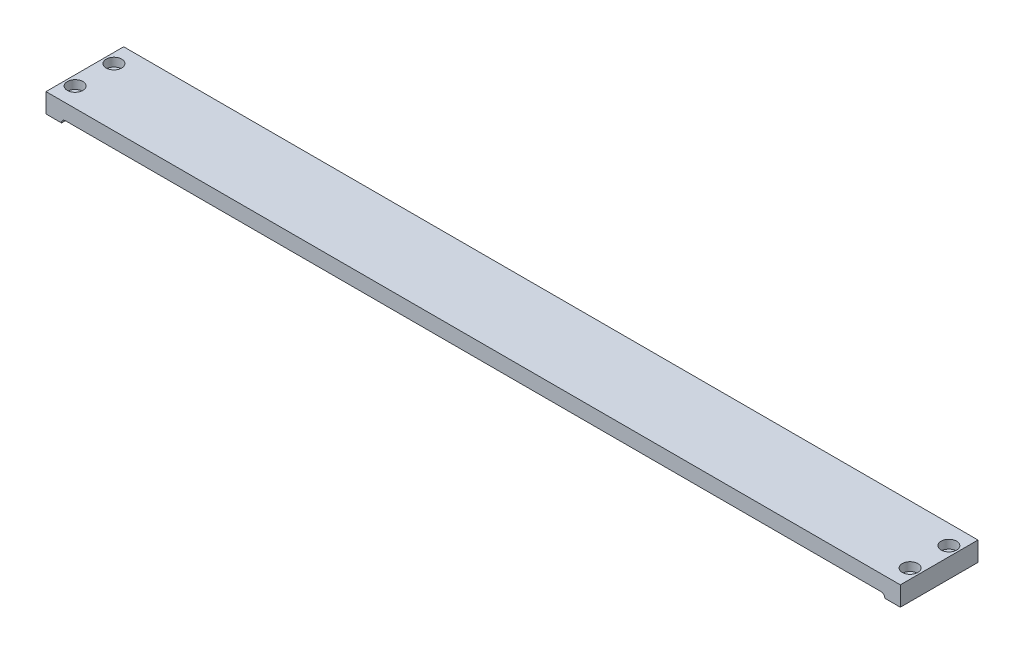
ISO-10303-21;
HEADER;
FILE_DESCRIPTION(('STEP AP214'),'2;1');
FILE_NAME('part.step','',(''),(''),'','','');
FILE_SCHEMA(('AUTOMOTIVE_DESIGN { 1 0 10303 214 1 1 1 1 }'));
ENDSEC;
DATA;
#1=APPLICATION_CONTEXT('core data for automotive mechanical design processes');
#2=APPLICATION_PROTOCOL_DEFINITION('international standard','automotive_design',2000,#1);
#3=PRODUCT_CONTEXT('',#1,'mechanical');
#4=PRODUCT('Part','Part','',(#3));
#5=PRODUCT_RELATED_PRODUCT_CATEGORY('part','',(#4));
#6=PRODUCT_DEFINITION_FORMATION('','',#4);
#7=PRODUCT_DEFINITION_CONTEXT('part definition',#1,'design');
#8=PRODUCT_DEFINITION('design','',#6,#7);
#9=PRODUCT_DEFINITION_SHAPE('','',#8);
#10=(LENGTH_UNIT() NAMED_UNIT(*) SI_UNIT(.MILLI.,.METRE.));
#11=(NAMED_UNIT(*) PLANE_ANGLE_UNIT() SI_UNIT($,.RADIAN.));
#12=(NAMED_UNIT(*) SI_UNIT($,.STERADIAN.) SOLID_ANGLE_UNIT());
#13=UNCERTAINTY_MEASURE_WITH_UNIT(LENGTH_MEASURE(1.E-05),#10,'distance_accuracy_value','');
#14=(GEOMETRIC_REPRESENTATION_CONTEXT(3) GLOBAL_UNCERTAINTY_ASSIGNED_CONTEXT((#13)) GLOBAL_UNIT_ASSIGNED_CONTEXT((#10,
#11,#12)) REPRESENTATION_CONTEXT('',''));
#15=CARTESIAN_POINT('',(0.,0.,0.));
#16=DIRECTION('',(0.,0.,1.));
#17=DIRECTION('',(1.,0.,0.));
#18=AXIS2_PLACEMENT_3D('',#15,#16,#17);
#19=CARTESIAN_POINT('',(220.,10.,20.));
#20=DIRECTION('',(-1.,0.,0.));
#21=DIRECTION('',(0.,0.,1.));
#22=AXIS2_PLACEMENT_3D('',#19,#20,#21);
#23=PLANE('',#22);
#24=DIRECTION('',(0.,0.,-1.));
#25=VECTOR('',#24,1.);
#26=CARTESIAN_POINT('',(220.,0.,20.));
#27=LINE('',#26,#25);
#28=CARTESIAN_POINT('',(220.,0.,20.));
#29=VERTEX_POINT('',#28);
#30=CARTESIAN_POINT('',(220.,0.,-20.));
#31=VERTEX_POINT('',#30);
#32=EDGE_CURVE('E184',#29,#31,#27,.T.);
#33=ORIENTED_EDGE('',*,*,#32,.T.);
#34=DIRECTION('',(0.,-1.,0.));
#35=VECTOR('',#34,1.);
#36=CARTESIAN_POINT('',(220.,10.,-20.));
#37=LINE('',#36,#35);
#38=CARTESIAN_POINT('',(220.,10.,-20.));
#39=VERTEX_POINT('',#38);
#40=EDGE_CURVE('E215',#39,#31,#37,.T.);
#41=ORIENTED_EDGE('',*,*,#40,.F.);
#42=DIRECTION('',(0.,0.,-1.));
#43=VECTOR('',#42,1.);
#44=CARTESIAN_POINT('',(220.,10.,20.));
#45=LINE('',#44,#43);
#46=CARTESIAN_POINT('',(220.,10.,20.));
#47=VERTEX_POINT('',#46);
#48=EDGE_CURVE('E187',#47,#39,#45,.T.);
#49=ORIENTED_EDGE('',*,*,#48,.F.);
#50=DIRECTION('',(0.,-1.,0.));
#51=VECTOR('',#50,1.);
#52=CARTESIAN_POINT('',(220.,10.,20.));
#53=LINE('',#52,#51);
#54=EDGE_CURVE('E197',#47,#29,#53,.T.);
#55=ORIENTED_EDGE('',*,*,#54,.T.);
#56=EDGE_LOOP('',(#33,#41,#49,#55));
#57=FACE_BOUND('',#56,.T.);
#58=ADVANCED_FACE('F34',(#57),#23,.F.);
#59=CARTESIAN_POINT('',(-220.,10.,-20.));
#60=DIRECTION('',(0.,0.,1.));
#61=DIRECTION('',(1.,0.,0.));
#62=AXIS2_PLACEMENT_3D('',#59,#60,#61);
#63=PLANE('',#62);
#64=CARTESIAN_POINT('',(-125.,5.,-20.));
#65=DIRECTION('',(0.,0.,-1.));
#66=DIRECTION('',(-1.,0.,0.));
#67=AXIS2_PLACEMENT_3D('',#64,#65,#66);
#68=CIRCLE('',#67,1.65);
#69=CARTESIAN_POINT('',(-126.65,5.,-20.));
#70=VERTEX_POINT('',#69);
#71=EDGE_CURVE('E119',#70,#70,#68,.T.);
#72=ORIENTED_EDGE('',*,*,#71,.F.);
#73=EDGE_LOOP('',(#72));
#74=FACE_BOUND('',#73,.T.);
#75=CARTESIAN_POINT('',(0.,5.,-20.));
#76=DIRECTION('',(0.,0.,-1.));
#77=DIRECTION('',(-1.,0.,0.));
#78=AXIS2_PLACEMENT_3D('',#75,#76,#77);
#79=CIRCLE('',#78,1.65);
#80=CARTESIAN_POINT('',(-1.65,5.,-20.));
#81=VERTEX_POINT('',#80);
#82=EDGE_CURVE('E118',#81,#81,#79,.T.);
#83=ORIENTED_EDGE('',*,*,#82,.F.);
#84=EDGE_LOOP('',(#83));
#85=FACE_BOUND('',#84,.T.);
#86=CARTESIAN_POINT('',(125.,5.,-20.));
#87=DIRECTION('',(0.,0.,-1.));
#88=DIRECTION('',(-1.,0.,0.));
#89=AXIS2_PLACEMENT_3D('',#86,#87,#88);
#90=CIRCLE('',#89,1.64999999999998);
#91=CARTESIAN_POINT('',(123.35,5.,-20.));
#92=VERTEX_POINT('',#91);
#93=EDGE_CURVE('E129',#92,#92,#90,.T.);
#94=ORIENTED_EDGE('',*,*,#93,.F.);
#95=EDGE_LOOP('',(#94));
#96=FACE_BOUND('',#95,.T.);
#97=DIRECTION('',(-1.,0.,0.));
#98=VECTOR('',#97,1.);
#99=CARTESIAN_POINT('',(-220.,0.,-20.));
#100=LINE('',#99,#98);
#101=CARTESIAN_POINT('',(-220.,0.,-20.));
#102=VERTEX_POINT('',#101);
#103=EDGE_CURVE('E200',#31,#102,#100,.T.);
#104=ORIENTED_EDGE('',*,*,#103,.T.);
#105=DIRECTION('',(0.,-1.,0.));
#106=VECTOR('',#105,1.);
#107=CARTESIAN_POINT('',(-220.,10.,-20.));
#108=LINE('',#107,#106);
#109=CARTESIAN_POINT('',(-220.,10.,-20.));
#110=VERTEX_POINT('',#109);
#111=EDGE_CURVE('E212',#110,#102,#108,.T.);
#112=ORIENTED_EDGE('',*,*,#111,.F.);
#113=DIRECTION('',(-1.,0.,0.));
#114=VECTOR('',#113,1.);
#115=CARTESIAN_POINT('',(-220.,10.,-20.));
#116=LINE('',#115,#114);
#117=EDGE_CURVE('E190',#39,#110,#116,.T.);
#118=ORIENTED_EDGE('',*,*,#117,.F.);
#119=ORIENTED_EDGE('',*,*,#40,.T.);
#120=EDGE_LOOP('',(#104,#112,#118,#119));
#121=FACE_BOUND('',#120,.T.);
#122=ADVANCED_FACE('F267',(#74,#85,#96,#121),#63,.F.);
#123=CARTESIAN_POINT('',(-220.,10.,20.));
#124=DIRECTION('',(1.,0.,0.));
#125=DIRECTION('',(0.,0.,-1.));
#126=AXIS2_PLACEMENT_3D('',#123,#124,#125);
#127=PLANE('',#126);
#128=DIRECTION('',(0.,0.,1.));
#129=VECTOR('',#128,1.);
#130=CARTESIAN_POINT('',(-220.,0.,20.));
#131=LINE('',#130,#129);
#132=CARTESIAN_POINT('',(-220.,0.,20.));
#133=VERTEX_POINT('',#132);
#134=EDGE_CURVE('E202',#102,#133,#131,.T.);
#135=ORIENTED_EDGE('',*,*,#134,.T.);
#136=DIRECTION('',(0.,-1.,0.));
#137=VECTOR('',#136,1.);
#138=CARTESIAN_POINT('',(-220.,10.,20.));
#139=LINE('',#138,#137);
#140=CARTESIAN_POINT('',(-220.,10.,20.));
#141=VERTEX_POINT('',#140);
#142=EDGE_CURVE('E209',#141,#133,#139,.T.);
#143=ORIENTED_EDGE('',*,*,#142,.F.);
#144=DIRECTION('',(0.,0.,1.));
#145=VECTOR('',#144,1.);
#146=CARTESIAN_POINT('',(-220.,10.,20.));
#147=LINE('',#146,#145);
#148=EDGE_CURVE('E193',#110,#141,#147,.T.);
#149=ORIENTED_EDGE('',*,*,#148,.F.);
#150=ORIENTED_EDGE('',*,*,#111,.T.);
#151=EDGE_LOOP('',(#135,#143,#149,#150));
#152=FACE_BOUND('',#151,.T.);
#153=ADVANCED_FACE('F261',(#152),#127,.F.);
#154=CARTESIAN_POINT('',(-220.,10.,20.));
#155=DIRECTION('',(0.,0.,-1.));
#156=DIRECTION('',(-1.,0.,0.));
#157=AXIS2_PLACEMENT_3D('',#154,#155,#156);
#158=PLANE('',#157);
#159=DIRECTION('',(1.,0.,0.));
#160=VECTOR('',#159,1.);
#161=CARTESIAN_POINT('',(-220.,0.,20.));
#162=LINE('',#161,#160);
#163=CARTESIAN_POINT('',(-212.,0.,20.));
#164=VERTEX_POINT('',#163);
#165=EDGE_CURVE('E191',#133,#164,#162,.T.);
#166=ORIENTED_EDGE('',*,*,#165,.T.);
#167=CARTESIAN_POINT('',(-210.,0.,20.));
#168=DIRECTION('',(0.,0.,-1.));
#169=DIRECTION('',(-1.,0.,0.));
#170=AXIS2_PLACEMENT_3D('',#167,#168,#169);
#171=CIRCLE('',#170,2.);
#172=CARTESIAN_POINT('',(-210.,2.,20.));
#173=VERTEX_POINT('',#172);
#174=EDGE_CURVE('E43',#164,#173,#171,.T.);
#175=ORIENTED_EDGE('',*,*,#174,.T.);
#176=DIRECTION('',(-1.,0.,0.));
#177=VECTOR('',#176,1.);
#178=CARTESIAN_POINT('',(-212.,2.,20.));
#179=LINE('',#178,#177);
#180=CARTESIAN_POINT('',(210.,2.,20.));
#181=VERTEX_POINT('',#180);
#182=EDGE_CURVE('E177',#181,#173,#179,.T.);
#183=ORIENTED_EDGE('',*,*,#182,.F.);
#184=CARTESIAN_POINT('',(210.,0.,20.));
#185=DIRECTION('',(0.,0.,-1.));
#186=DIRECTION('',(-1.,0.,0.));
#187=AXIS2_PLACEMENT_3D('',#184,#185,#186);
#188=CIRCLE('',#187,2.);
#189=CARTESIAN_POINT('',(212.,0.,20.));
#190=VERTEX_POINT('',#189);
#191=EDGE_CURVE('E11',#181,#190,#188,.T.);
#192=ORIENTED_EDGE('',*,*,#191,.T.);
#193=EDGE_CURVE('E204',#190,#29,#162,.T.);
#194=ORIENTED_EDGE('',*,*,#193,.T.);
#195=ORIENTED_EDGE('',*,*,#54,.F.);
#196=DIRECTION('',(1.,0.,0.));
#197=VECTOR('',#196,1.);
#198=CARTESIAN_POINT('',(-220.,10.,20.));
#199=LINE('',#198,#197);
#200=EDGE_CURVE('E195',#141,#47,#199,.T.);
#201=ORIENTED_EDGE('',*,*,#200,.F.);
#202=ORIENTED_EDGE('',*,*,#142,.T.);
#203=EDGE_LOOP('',(#166,#175,#183,#192,#194,#195,#201,#202));
#204=FACE_BOUND('',#203,.T.);
#205=ADVANCED_FACE('F254',(#204),#158,.F.);
#206=CARTESIAN_POINT('',(0.,10.,0.));
#207=DIRECTION('',(0.,-1.,0.));
#208=DIRECTION('',(0.,0.,-1.));
#209=AXIS2_PLACEMENT_3D('',#206,#207,#208);
#210=PLANE('',#209);
#211=CARTESIAN_POINT('',(215.,10.,-10.));
#212=DIRECTION('',(0.,1.,0.));
#213=DIRECTION('',(0.,0.,1.));
#214=AXIS2_PLACEMENT_3D('',#211,#212,#213);
#215=CIRCLE('',#214,4.);
#216=CARTESIAN_POINT('',(215.,10.,-6.));
#217=VERTEX_POINT('',#216);
#218=EDGE_CURVE('E135',#217,#217,#215,.T.);
#219=ORIENTED_EDGE('',*,*,#218,.F.);
#220=EDGE_LOOP('',(#219));
#221=FACE_BOUND('',#220,.T.);
#222=CARTESIAN_POINT('',(215.,10.,10.));
#223=DIRECTION('',(0.,1.,0.));
#224=DIRECTION('',(0.,0.,1.));
#225=AXIS2_PLACEMENT_3D('',#222,#223,#224);
#226=CIRCLE('',#225,4.);
#227=CARTESIAN_POINT('',(215.,10.,14.));
#228=VERTEX_POINT('',#227);
#229=EDGE_CURVE('E144',#228,#228,#226,.T.);
#230=ORIENTED_EDGE('',*,*,#229,.F.);
#231=EDGE_LOOP('',(#230));
#232=FACE_BOUND('',#231,.T.);
#233=CARTESIAN_POINT('',(-215.,10.,-10.));
#234=DIRECTION('',(0.,1.,0.));
#235=DIRECTION('',(0.,0.,1.));
#236=AXIS2_PLACEMENT_3D('',#233,#234,#235);
#237=CIRCLE('',#236,4.);
#238=CARTESIAN_POINT('',(-215.,10.,-6.));
#239=VERTEX_POINT('',#238);
#240=EDGE_CURVE('E154',#239,#239,#237,.T.);
#241=ORIENTED_EDGE('',*,*,#240,.F.);
#242=EDGE_LOOP('',(#241));
#243=FACE_BOUND('',#242,.T.);
#244=CARTESIAN_POINT('',(-215.,10.,10.));
#245=DIRECTION('',(0.,1.,0.));
#246=DIRECTION('',(0.,0.,1.));
#247=AXIS2_PLACEMENT_3D('',#244,#245,#246);
#248=CIRCLE('',#247,4.);
#249=CARTESIAN_POINT('',(-215.,10.,14.));
#250=VERTEX_POINT('',#249);
#251=EDGE_CURVE('E164',#250,#250,#248,.T.);
#252=ORIENTED_EDGE('',*,*,#251,.F.);
#253=EDGE_LOOP('',(#252));
#254=FACE_BOUND('',#253,.T.);
#255=ORIENTED_EDGE('',*,*,#48,.T.);
#256=ORIENTED_EDGE('',*,*,#117,.T.);
#257=ORIENTED_EDGE('',*,*,#148,.T.);
#258=ORIENTED_EDGE('',*,*,#200,.T.);
#259=EDGE_LOOP('',(#255,#256,#257,#258));
#260=FACE_BOUND('',#259,.T.);
#261=ADVANCED_FACE('F239',(#221,#232,#243,#254,#260),#210,.F.);
#262=CARTESIAN_POINT('',(0.,0.,0.));
#263=DIRECTION('',(0.,-1.,0.));
#264=DIRECTION('',(0.,0.,-1.));
#265=AXIS2_PLACEMENT_3D('',#262,#263,#264);
#266=PLANE('',#265);
#267=CARTESIAN_POINT('',(215.,0.,-10.));
#268=DIRECTION('',(0.,-1.,0.));
#269=DIRECTION('',(0.,0.,-1.));
#270=AXIS2_PLACEMENT_3D('',#267,#268,#269);
#271=CIRCLE('',#270,2.25);
#272=CARTESIAN_POINT('',(215.,0.,-12.25));
#273=VERTEX_POINT('',#272);
#274=EDGE_CURVE('E38',#273,#273,#271,.T.);
#275=ORIENTED_EDGE('',*,*,#274,.F.);
#276=EDGE_LOOP('',(#275));
#277=FACE_BOUND('',#276,.T.);
#278=CARTESIAN_POINT('',(215.,0.,10.));
#279=DIRECTION('',(0.,-1.,0.));
#280=DIRECTION('',(0.,0.,-1.));
#281=AXIS2_PLACEMENT_3D('',#278,#279,#280);
#282=CIRCLE('',#281,2.25);
#283=CARTESIAN_POINT('',(215.,0.,7.75));
#284=VERTEX_POINT('',#283);
#285=EDGE_CURVE('E153',#284,#284,#282,.T.);
#286=ORIENTED_EDGE('',*,*,#285,.F.);
#287=EDGE_LOOP('',(#286));
#288=FACE_BOUND('',#287,.T.);
#289=CARTESIAN_POINT('',(-215.,0.,-10.));
#290=DIRECTION('',(0.,-1.,0.));
#291=DIRECTION('',(0.,0.,-1.));
#292=AXIS2_PLACEMENT_3D('',#289,#290,#291);
#293=CIRCLE('',#292,2.25);
#294=CARTESIAN_POINT('',(-215.,0.,-12.25));
#295=VERTEX_POINT('',#294);
#296=EDGE_CURVE('E163',#295,#295,#293,.T.);
#297=ORIENTED_EDGE('',*,*,#296,.F.);
#298=EDGE_LOOP('',(#297));
#299=FACE_BOUND('',#298,.T.);
#300=CARTESIAN_POINT('',(-215.,0.,10.));
#301=DIRECTION('',(0.,-1.,0.));
#302=DIRECTION('',(0.,0.,-1.));
#303=AXIS2_PLACEMENT_3D('',#300,#301,#302);
#304=CIRCLE('',#303,2.25);
#305=CARTESIAN_POINT('',(-215.,0.,7.75));
#306=VERTEX_POINT('',#305);
#307=EDGE_CURVE('E173',#306,#306,#304,.T.);
#308=ORIENTED_EDGE('',*,*,#307,.F.);
#309=EDGE_LOOP('',(#308));
#310=FACE_BOUND('',#309,.T.);
#311=DIRECTION('',(0.,0.,1.));
#312=VECTOR('',#311,1.);
#313=CARTESIAN_POINT('',(-212.,0.,18.));
#314=LINE('',#313,#312);
#315=CARTESIAN_POINT('',(-212.,0.,18.));
#316=VERTEX_POINT('',#315);
#317=EDGE_CURVE('E179',#316,#164,#314,.T.);
#318=ORIENTED_EDGE('',*,*,#317,.T.);
#319=ORIENTED_EDGE('',*,*,#165,.F.);
#320=ORIENTED_EDGE('',*,*,#134,.F.);
#321=ORIENTED_EDGE('',*,*,#103,.F.);
#322=ORIENTED_EDGE('',*,*,#32,.F.);
#323=ORIENTED_EDGE('',*,*,#193,.F.);
#324=DIRECTION('',(0.,0.,1.));
#325=VECTOR('',#324,1.);
#326=CARTESIAN_POINT('',(212.,0.,18.));
#327=LINE('',#326,#325);
#328=CARTESIAN_POINT('',(212.,0.,18.));
#329=VERTEX_POINT('',#328);
#330=EDGE_CURVE('E181',#329,#190,#327,.T.);
#331=ORIENTED_EDGE('',*,*,#330,.F.);
#332=DIRECTION('',(1.,0.,0.));
#333=VECTOR('',#332,1.);
#334=CARTESIAN_POINT('',(-212.,0.,18.));
#335=LINE('',#334,#333);
#336=EDGE_CURVE('E174',#316,#329,#335,.T.);
#337=ORIENTED_EDGE('',*,*,#336,.F.);
#338=EDGE_LOOP('',(#318,#319,#320,#321,#322,#323,#331,#337));
#339=FACE_BOUND('',#338,.T.);
#340=ADVANCED_FACE('F235',(#277,#288,#299,#310,#339),#266,.T.);
#341=CARTESIAN_POINT('',(-212.,2.,18.));
#342=DIRECTION('',(0.,1.,0.));
#343=DIRECTION('',(0.,0.,1.));
#344=AXIS2_PLACEMENT_3D('',#341,#342,#343);
#345=PLANE('',#344);
#346=ORIENTED_EDGE('',*,*,#182,.T.);
#347=DIRECTION('',(0.,0.,1.));
#348=VECTOR('',#347,1.);
#349=CARTESIAN_POINT('',(-210.,2.,18.));
#350=LINE('',#349,#348);
#351=CARTESIAN_POINT('',(-210.,2.,18.));
#352=VERTEX_POINT('',#351);
#353=EDGE_CURVE('E51',#173,#352,#350,.F.);
#354=ORIENTED_EDGE('',*,*,#353,.T.);
#355=DIRECTION('',(-1.,0.,0.));
#356=VECTOR('',#355,1.);
#357=CARTESIAN_POINT('',(-212.,2.,18.));
#358=LINE('',#357,#356);
#359=CARTESIAN_POINT('',(210.,2.,18.));
#360=VERTEX_POINT('',#359);
#361=EDGE_CURVE('E176',#360,#352,#358,.T.);
#362=ORIENTED_EDGE('',*,*,#361,.F.);
#363=DIRECTION('',(0.,0.,1.));
#364=VECTOR('',#363,1.);
#365=CARTESIAN_POINT('',(210.,2.,20.));
#366=LINE('',#365,#364);
#367=EDGE_CURVE('E218',#360,#181,#366,.T.);
#368=ORIENTED_EDGE('',*,*,#367,.T.);
#369=EDGE_LOOP('',(#346,#354,#362,#368));
#370=FACE_BOUND('',#369,.T.);
#371=ADVANCED_FACE('F238',(#370),#345,.F.);
#372=CARTESIAN_POINT('',(0.,0.,18.));
#373=DIRECTION('',(0.,0.,-1.));
#374=DIRECTION('',(-1.,0.,0.));
#375=AXIS2_PLACEMENT_3D('',#372,#373,#374);
#376=PLANE('',#375);
#377=ORIENTED_EDGE('',*,*,#361,.T.);
#378=CARTESIAN_POINT('',(-210.,0.,18.));
#379=DIRECTION('',(0.,0.,-1.));
#380=DIRECTION('',(-1.,0.,0.));
#381=AXIS2_PLACEMENT_3D('',#378,#379,#380);
#382=CIRCLE('',#381,2.);
#383=EDGE_CURVE('E223',#352,#316,#382,.F.);
#384=ORIENTED_EDGE('',*,*,#383,.T.);
#385=ORIENTED_EDGE('',*,*,#336,.T.);
#386=CARTESIAN_POINT('',(210.,0.,18.));
#387=DIRECTION('',(0.,0.,-1.));
#388=DIRECTION('',(-1.,0.,0.));
#389=AXIS2_PLACEMENT_3D('',#386,#387,#388);
#390=CIRCLE('',#389,2.);
#391=EDGE_CURVE('E58',#329,#360,#390,.F.);
#392=ORIENTED_EDGE('',*,*,#391,.T.);
#393=EDGE_LOOP('',(#377,#384,#385,#392));
#394=FACE_BOUND('',#393,.T.);
#395=ADVANCED_FACE('F272',(#394),#376,.F.);
#396=CARTESIAN_POINT('',(-210.,0.,18.));
#397=DIRECTION('',(0.,0.,-1.));
#398=DIRECTION('',(-1.,0.,0.));
#399=AXIS2_PLACEMENT_3D('',#396,#397,#398);
#400=CYLINDRICAL_SURFACE('',#399,2.);
#401=ORIENTED_EDGE('',*,*,#383,.F.);
#402=ORIENTED_EDGE('',*,*,#353,.F.);
#403=ORIENTED_EDGE('',*,*,#174,.F.);
#404=ORIENTED_EDGE('',*,*,#317,.F.);
#405=EDGE_LOOP('',(#401,#402,#403,#404));
#406=FACE_BOUND('',#405,.T.);
#407=ADVANCED_FACE('F273',(#406),#400,.F.);
#408=CARTESIAN_POINT('',(210.,0.,18.));
#409=DIRECTION('',(0.,0.,-1.));
#410=DIRECTION('',(-1.,0.,0.));
#411=AXIS2_PLACEMENT_3D('',#408,#409,#410);
#412=CYLINDRICAL_SURFACE('',#411,2.);
#413=ORIENTED_EDGE('',*,*,#391,.F.);
#414=ORIENTED_EDGE('',*,*,#330,.T.);
#415=ORIENTED_EDGE('',*,*,#191,.F.);
#416=ORIENTED_EDGE('',*,*,#367,.F.);
#417=EDGE_LOOP('',(#413,#414,#415,#416));
#418=FACE_BOUND('',#417,.T.);
#419=ADVANCED_FACE('F36',(#418),#412,.F.);
#420=CARTESIAN_POINT('',(-215.,10.,10.));
#421=DIRECTION('',(0.,1.,0.));
#422=DIRECTION('',(0.,0.,1.));
#423=AXIS2_PLACEMENT_3D('',#420,#421,#422);
#424=CYLINDRICAL_SURFACE('',#423,2.25);
#425=ORIENTED_EDGE('',*,*,#307,.T.);
#426=EDGE_LOOP('',(#425));
#427=FACE_BOUND('',#426,.T.);
#428=CARTESIAN_POINT('',(-215.,5.6,10.));
#429=DIRECTION('',(0.,1.,0.));
#430=DIRECTION('',(0.,0.,1.));
#431=AXIS2_PLACEMENT_3D('',#428,#429,#430);
#432=CIRCLE('',#431,2.25);
#433=CARTESIAN_POINT('',(-215.,5.6,12.25));
#434=VERTEX_POINT('',#433);
#435=EDGE_CURVE('E170',#434,#434,#432,.T.);
#436=ORIENTED_EDGE('',*,*,#435,.T.);
#437=EDGE_LOOP('',(#436));
#438=FACE_BOUND('',#437,.T.);
#439=ADVANCED_FACE('F279',(#427,#438),#424,.F.);
#440=CARTESIAN_POINT('',(-212.75,5.6,10.));
#441=DIRECTION('',(0.,-1.,0.));
#442=DIRECTION('',(0.,0.,-1.));
#443=AXIS2_PLACEMENT_3D('',#440,#441,#442);
#444=PLANE('',#443);
#445=ORIENTED_EDGE('',*,*,#435,.F.);
#446=EDGE_LOOP('',(#445));
#447=FACE_BOUND('',#446,.T.);
#448=CARTESIAN_POINT('',(-215.,5.6,10.));
#449=DIRECTION('',(0.,1.,0.));
#450=DIRECTION('',(0.,0.,1.));
#451=AXIS2_PLACEMENT_3D('',#448,#449,#450);
#452=CIRCLE('',#451,4.);
#453=CARTESIAN_POINT('',(-215.,5.6,14.));
#454=VERTEX_POINT('',#453);
#455=EDGE_CURVE('E167',#454,#454,#452,.T.);
#456=ORIENTED_EDGE('',*,*,#455,.T.);
#457=EDGE_LOOP('',(#456));
#458=FACE_BOUND('',#457,.T.);
#459=ADVANCED_FACE('F300',(#447,#458),#444,.F.);
#460=CARTESIAN_POINT('',(-215.,10.,10.));
#461=DIRECTION('',(0.,1.,0.));
#462=DIRECTION('',(0.,0.,1.));
#463=AXIS2_PLACEMENT_3D('',#460,#461,#462);
#464=CYLINDRICAL_SURFACE('',#463,4.);
#465=ORIENTED_EDGE('',*,*,#455,.F.);
#466=EDGE_LOOP('',(#465));
#467=FACE_BOUND('',#466,.T.);
#468=ORIENTED_EDGE('',*,*,#251,.T.);
#469=EDGE_LOOP('',(#468));
#470=FACE_BOUND('',#469,.T.);
#471=ADVANCED_FACE('F304',(#467,#470),#464,.F.);
#472=CARTESIAN_POINT('',(-215.,10.,-10.));
#473=DIRECTION('',(0.,1.,0.));
#474=DIRECTION('',(0.,0.,1.));
#475=AXIS2_PLACEMENT_3D('',#472,#473,#474);
#476=CYLINDRICAL_SURFACE('',#475,2.25);
#477=ORIENTED_EDGE('',*,*,#296,.T.);
#478=EDGE_LOOP('',(#477));
#479=FACE_BOUND('',#478,.T.);
#480=CARTESIAN_POINT('',(-215.,5.6,-10.));
#481=DIRECTION('',(0.,1.,0.));
#482=DIRECTION('',(0.,0.,1.));
#483=AXIS2_PLACEMENT_3D('',#480,#481,#482);
#484=CIRCLE('',#483,2.25);
#485=CARTESIAN_POINT('',(-215.,5.6,-7.75));
#486=VERTEX_POINT('',#485);
#487=EDGE_CURVE('E160',#486,#486,#484,.T.);
#488=ORIENTED_EDGE('',*,*,#487,.T.);
#489=EDGE_LOOP('',(#488));
#490=FACE_BOUND('',#489,.T.);
#491=ADVANCED_FACE('F308',(#479,#490),#476,.F.);
#492=CARTESIAN_POINT('',(-212.75,5.6,-10.));
#493=DIRECTION('',(0.,-1.,0.));
#494=DIRECTION('',(0.,0.,-1.));
#495=AXIS2_PLACEMENT_3D('',#492,#493,#494);
#496=PLANE('',#495);
#497=ORIENTED_EDGE('',*,*,#487,.F.);
#498=EDGE_LOOP('',(#497));
#499=FACE_BOUND('',#498,.T.);
#500=CARTESIAN_POINT('',(-215.,5.6,-10.));
#501=DIRECTION('',(0.,1.,0.));
#502=DIRECTION('',(0.,0.,1.));
#503=AXIS2_PLACEMENT_3D('',#500,#501,#502);
#504=CIRCLE('',#503,4.);
#505=CARTESIAN_POINT('',(-215.,5.6,-6.));
#506=VERTEX_POINT('',#505);
#507=EDGE_CURVE('E157',#506,#506,#504,.T.);
#508=ORIENTED_EDGE('',*,*,#507,.T.);
#509=EDGE_LOOP('',(#508));
#510=FACE_BOUND('',#509,.T.);
#511=ADVANCED_FACE('F312',(#499,#510),#496,.F.);
#512=CARTESIAN_POINT('',(-215.,10.,-10.));
#513=DIRECTION('',(0.,1.,0.));
#514=DIRECTION('',(0.,0.,1.));
#515=AXIS2_PLACEMENT_3D('',#512,#513,#514);
#516=CYLINDRICAL_SURFACE('',#515,4.);
#517=ORIENTED_EDGE('',*,*,#507,.F.);
#518=EDGE_LOOP('',(#517));
#519=FACE_BOUND('',#518,.T.);
#520=ORIENTED_EDGE('',*,*,#240,.T.);
#521=EDGE_LOOP('',(#520));
#522=FACE_BOUND('',#521,.T.);
#523=ADVANCED_FACE('F316',(#519,#522),#516,.F.);
#524=CARTESIAN_POINT('',(215.,10.,10.));
#525=DIRECTION('',(0.,1.,0.));
#526=DIRECTION('',(0.,0.,1.));
#527=AXIS2_PLACEMENT_3D('',#524,#525,#526);
#528=CYLINDRICAL_SURFACE('',#527,2.25);
#529=ORIENTED_EDGE('',*,*,#285,.T.);
#530=EDGE_LOOP('',(#529));
#531=FACE_BOUND('',#530,.T.);
#532=CARTESIAN_POINT('',(215.,5.6,10.));
#533=DIRECTION('',(0.,1.,0.));
#534=DIRECTION('',(0.,0.,1.));
#535=AXIS2_PLACEMENT_3D('',#532,#533,#534);
#536=CIRCLE('',#535,2.25);
#537=CARTESIAN_POINT('',(215.,5.6,12.25));
#538=VERTEX_POINT('',#537);
#539=EDGE_CURVE('E150',#538,#538,#536,.T.);
#540=ORIENTED_EDGE('',*,*,#539,.T.);
#541=EDGE_LOOP('',(#540));
#542=FACE_BOUND('',#541,.T.);
#543=ADVANCED_FACE('F232',(#531,#542),#528,.F.);
#544=CARTESIAN_POINT('',(217.25,5.6,10.));
#545=DIRECTION('',(0.,-1.,0.));
#546=DIRECTION('',(0.,0.,-1.));
#547=AXIS2_PLACEMENT_3D('',#544,#545,#546);
#548=PLANE('',#547);
#549=ORIENTED_EDGE('',*,*,#539,.F.);
#550=EDGE_LOOP('',(#549));
#551=FACE_BOUND('',#550,.T.);
#552=CARTESIAN_POINT('',(215.,5.6,10.));
#553=DIRECTION('',(0.,1.,0.));
#554=DIRECTION('',(0.,0.,1.));
#555=AXIS2_PLACEMENT_3D('',#552,#553,#554);
#556=CIRCLE('',#555,4.);
#557=CARTESIAN_POINT('',(215.,5.6,14.));
#558=VERTEX_POINT('',#557);
#559=EDGE_CURVE('E147',#558,#558,#556,.T.);
#560=ORIENTED_EDGE('',*,*,#559,.T.);
#561=EDGE_LOOP('',(#560));
#562=FACE_BOUND('',#561,.T.);
#563=ADVANCED_FACE('F323',(#551,#562),#548,.F.);
#564=CARTESIAN_POINT('',(215.,10.,10.));
#565=DIRECTION('',(0.,1.,0.));
#566=DIRECTION('',(0.,0.,1.));
#567=AXIS2_PLACEMENT_3D('',#564,#565,#566);
#568=CYLINDRICAL_SURFACE('',#567,4.);
#569=ORIENTED_EDGE('',*,*,#559,.F.);
#570=EDGE_LOOP('',(#569));
#571=FACE_BOUND('',#570,.T.);
#572=ORIENTED_EDGE('',*,*,#229,.T.);
#573=EDGE_LOOP('',(#572));
#574=FACE_BOUND('',#573,.T.);
#575=ADVANCED_FACE('F326',(#571,#574),#568,.F.);
#576=CARTESIAN_POINT('',(215.,10.,-10.));
#577=DIRECTION('',(0.,1.,0.));
#578=DIRECTION('',(0.,0.,1.));
#579=AXIS2_PLACEMENT_3D('',#576,#577,#578);
#580=CYLINDRICAL_SURFACE('',#579,2.25);
#581=ORIENTED_EDGE('',*,*,#274,.T.);
#582=EDGE_LOOP('',(#581));
#583=FACE_BOUND('',#582,.T.);
#584=CARTESIAN_POINT('',(215.,5.6,-10.));
#585=DIRECTION('',(0.,1.,0.));
#586=DIRECTION('',(0.,0.,1.));
#587=AXIS2_PLACEMENT_3D('',#584,#585,#586);
#588=CIRCLE('',#587,2.25);
#589=CARTESIAN_POINT('',(215.,5.6,-7.75));
#590=VERTEX_POINT('',#589);
#591=EDGE_CURVE('E141',#590,#590,#588,.T.);
#592=ORIENTED_EDGE('',*,*,#591,.T.);
#593=EDGE_LOOP('',(#592));
#594=FACE_BOUND('',#593,.T.);
#595=ADVANCED_FACE('F330',(#583,#594),#580,.F.);
#596=CARTESIAN_POINT('',(217.25,5.6,-10.));
#597=DIRECTION('',(0.,-1.,0.));
#598=DIRECTION('',(0.,0.,-1.));
#599=AXIS2_PLACEMENT_3D('',#596,#597,#598);
#600=PLANE('',#599);
#601=ORIENTED_EDGE('',*,*,#591,.F.);
#602=EDGE_LOOP('',(#601));
#603=FACE_BOUND('',#602,.T.);
#604=CARTESIAN_POINT('',(215.,5.6,-10.));
#605=DIRECTION('',(0.,1.,0.));
#606=DIRECTION('',(0.,0.,1.));
#607=AXIS2_PLACEMENT_3D('',#604,#605,#606);
#608=CIRCLE('',#607,4.);
#609=CARTESIAN_POINT('',(215.,5.6,-6.));
#610=VERTEX_POINT('',#609);
#611=EDGE_CURVE('E138',#610,#610,#608,.T.);
#612=ORIENTED_EDGE('',*,*,#611,.T.);
#613=EDGE_LOOP('',(#612));
#614=FACE_BOUND('',#613,.T.);
#615=ADVANCED_FACE('F334',(#603,#614),#600,.F.);
#616=CARTESIAN_POINT('',(215.,10.,-10.));
#617=DIRECTION('',(0.,1.,0.));
#618=DIRECTION('',(0.,0.,1.));
#619=AXIS2_PLACEMENT_3D('',#616,#617,#618);
#620=CYLINDRICAL_SURFACE('',#619,4.);
#621=ORIENTED_EDGE('',*,*,#611,.F.);
#622=EDGE_LOOP('',(#621));
#623=FACE_BOUND('',#622,.T.);
#624=ORIENTED_EDGE('',*,*,#218,.T.);
#625=EDGE_LOOP('',(#624));
#626=FACE_BOUND('',#625,.T.);
#627=ADVANCED_FACE('F338',(#623,#626),#620,.F.);
#628=CARTESIAN_POINT('',(125.,5.,-6.));
#629=DIRECTION('',(0.,0.,-1.));
#630=DIRECTION('',(-1.,0.,0.));
#631=AXIS2_PLACEMENT_3D('',#628,#629,#630);
#632=CONICAL_SURFACE('',#631,1.64999999999998,1.02974425867665);
#633=CARTESIAN_POINT('',(125.,5.,-5.00857997860452));
#634=VERTEX_POINT('',#633);
#635=VERTEX_LOOP('',#634);
#636=FACE_BOUND('',#635,.T.);
#637=CARTESIAN_POINT('',(125.,5.,-6.));
#638=DIRECTION('',(0.,0.,-1.));
#639=DIRECTION('',(-1.,0.,0.));
#640=AXIS2_PLACEMENT_3D('',#637,#638,#639);
#641=CIRCLE('',#640,1.64999999999998);
#642=CARTESIAN_POINT('',(123.35,5.,-6.));
#643=VERTEX_POINT('',#642);
#644=EDGE_CURVE('E132',#643,#643,#641,.T.);
#645=ORIENTED_EDGE('',*,*,#644,.T.);
#646=EDGE_LOOP('',(#645));
#647=FACE_BOUND('',#646,.T.);
#648=ADVANCED_FACE('F342',(#636,#647),#632,.F.);
#649=CARTESIAN_POINT('',(125.,5.,-20.));
#650=DIRECTION('',(0.,0.,-1.));
#651=DIRECTION('',(-1.,0.,0.));
#652=AXIS2_PLACEMENT_3D('',#649,#650,#651);
#653=CYLINDRICAL_SURFACE('',#652,1.64999999999998);
#654=ORIENTED_EDGE('',*,*,#644,.F.);
#655=EDGE_LOOP('',(#654));
#656=FACE_BOUND('',#655,.T.);
#657=ORIENTED_EDGE('',*,*,#93,.T.);
#658=EDGE_LOOP('',(#657));
#659=FACE_BOUND('',#658,.T.);
#660=ADVANCED_FACE('F346',(#656,#659),#653,.F.);
#661=CARTESIAN_POINT('',(0.,5.,-6.));
#662=DIRECTION('',(0.,0.,-1.));
#663=DIRECTION('',(-1.,0.,0.));
#664=AXIS2_PLACEMENT_3D('',#661,#662,#663);
#665=CONICAL_SURFACE('',#664,1.65,1.02974425867665);
#666=CARTESIAN_POINT('',(0.,5.,-5.00857997860452));
#667=VERTEX_POINT('',#666);
#668=VERTEX_LOOP('',#667);
#669=FACE_BOUND('',#668,.T.);
#670=CARTESIAN_POINT('',(0.,5.,-6.));
#671=DIRECTION('',(0.,0.,-1.));
#672=DIRECTION('',(-1.,0.,0.));
#673=AXIS2_PLACEMENT_3D('',#670,#671,#672);
#674=CIRCLE('',#673,1.65);
#675=CARTESIAN_POINT('',(-1.65,5.,-6.));
#676=VERTEX_POINT('',#675);
#677=EDGE_CURVE('E122',#676,#676,#674,.T.);
#678=ORIENTED_EDGE('',*,*,#677,.T.);
#679=EDGE_LOOP('',(#678));
#680=FACE_BOUND('',#679,.T.);
#681=ADVANCED_FACE('F350',(#669,#680),#665,.F.);
#682=CARTESIAN_POINT('',(0.,5.,-20.));
#683=DIRECTION('',(0.,0.,-1.));
#684=DIRECTION('',(-1.,0.,0.));
#685=AXIS2_PLACEMENT_3D('',#682,#683,#684);
#686=CYLINDRICAL_SURFACE('',#685,1.65);
#687=ORIENTED_EDGE('',*,*,#677,.F.);
#688=EDGE_LOOP('',(#687));
#689=FACE_BOUND('',#688,.T.);
#690=ORIENTED_EDGE('',*,*,#82,.T.);
#691=EDGE_LOOP('',(#690));
#692=FACE_BOUND('',#691,.T.);
#693=ADVANCED_FACE('F112',(#689,#692),#686,.F.);
#694=CARTESIAN_POINT('',(-125.,5.,-6.));
#695=DIRECTION('',(0.,0.,-1.));
#696=DIRECTION('',(-1.,0.,0.));
#697=AXIS2_PLACEMENT_3D('',#694,#695,#696);
#698=CONICAL_SURFACE('',#697,1.65,1.02974425867665);
#699=CARTESIAN_POINT('',(-125.,5.,-5.00857997860452));
#700=VERTEX_POINT('',#699);
#701=VERTEX_LOOP('',#700);
#702=FACE_BOUND('',#701,.T.);
#703=CARTESIAN_POINT('',(-125.,5.,-6.));
#704=DIRECTION('',(0.,0.,-1.));
#705=DIRECTION('',(-1.,0.,0.));
#706=AXIS2_PLACEMENT_3D('',#703,#704,#705);
#707=CIRCLE('',#706,1.65);
#708=CARTESIAN_POINT('',(-126.65,5.,-6.));
#709=VERTEX_POINT('',#708);
#710=EDGE_CURVE('E116',#709,#709,#707,.T.);
#711=ORIENTED_EDGE('',*,*,#710,.T.);
#712=EDGE_LOOP('',(#711));
#713=FACE_BOUND('',#712,.T.);
#714=ADVANCED_FACE('F108',(#702,#713),#698,.F.);
#715=CARTESIAN_POINT('',(-125.,5.,-20.));
#716=DIRECTION('',(0.,0.,-1.));
#717=DIRECTION('',(-1.,0.,0.));
#718=AXIS2_PLACEMENT_3D('',#715,#716,#717);
#719=CYLINDRICAL_SURFACE('',#718,1.65);
#720=ORIENTED_EDGE('',*,*,#710,.F.);
#721=EDGE_LOOP('',(#720));
#722=FACE_BOUND('',#721,.T.);
#723=ORIENTED_EDGE('',*,*,#71,.T.);
#724=EDGE_LOOP('',(#723));
#725=FACE_BOUND('',#724,.T.);
#726=ADVANCED_FACE('F111',(#722,#725),#719,.F.);
#727=CLOSED_SHELL('',(#58,#122,#153,#205,#261,#340,#371,#395,#407,#419,#439,#459,#471,#491,#511,
#523,#543,#563,#575,#595,#615,#627,#648,#660,#681,#693,#714,#726));
#728=MANIFOLD_SOLID_BREP('B2',#727);
#729=ADVANCED_BREP_SHAPE_REPRESENTATION('',(#18,#728),#14);
#730=SHAPE_DEFINITION_REPRESENTATION(#9,#729);
ENDSEC;
END-ISO-10303-21;
